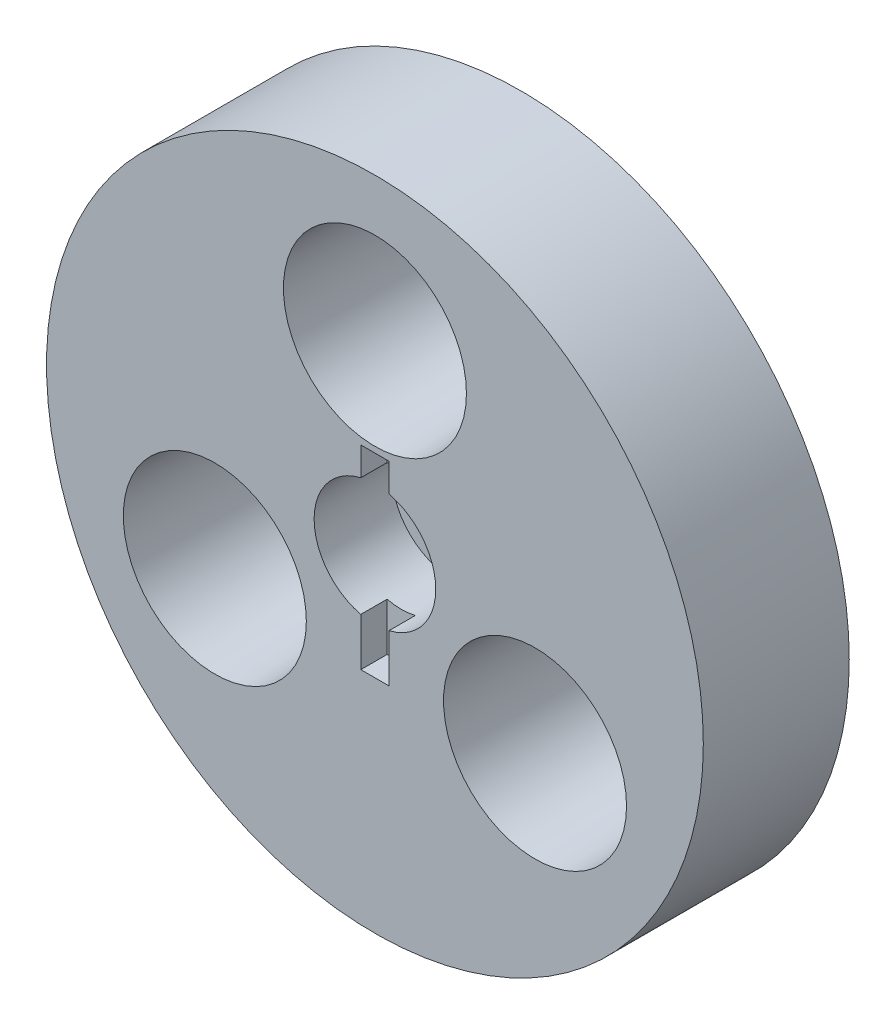
ISO-10303-21;
HEADER;
FILE_DESCRIPTION(('STEP AP214'),'2;1');
FILE_NAME('part.step','',(''),(''),'','','');
FILE_SCHEMA(('AUTOMOTIVE_DESIGN { 1 0 10303 214 1 1 1 1 }'));
ENDSEC;
DATA;
#1=APPLICATION_CONTEXT('core data for automotive mechanical design processes');
#2=APPLICATION_PROTOCOL_DEFINITION('international standard','automotive_design',2000,#1);
#3=PRODUCT_CONTEXT('',#1,'mechanical');
#4=PRODUCT('Part','Part','',(#3));
#5=PRODUCT_RELATED_PRODUCT_CATEGORY('part','',(#4));
#6=PRODUCT_DEFINITION_FORMATION('','',#4);
#7=PRODUCT_DEFINITION_CONTEXT('part definition',#1,'design');
#8=PRODUCT_DEFINITION('design','',#6,#7);
#9=PRODUCT_DEFINITION_SHAPE('','',#8);
#10=(LENGTH_UNIT() NAMED_UNIT(*) SI_UNIT(.MILLI.,.METRE.));
#11=(NAMED_UNIT(*) PLANE_ANGLE_UNIT() SI_UNIT($,.RADIAN.));
#12=(NAMED_UNIT(*) SI_UNIT($,.STERADIAN.) SOLID_ANGLE_UNIT());
#13=UNCERTAINTY_MEASURE_WITH_UNIT(LENGTH_MEASURE(1.E-05),#10,'distance_accuracy_value','');
#14=(GEOMETRIC_REPRESENTATION_CONTEXT(3) GLOBAL_UNCERTAINTY_ASSIGNED_CONTEXT((#13)) GLOBAL_UNIT_ASSIGNED_CONTEXT((#10,
#11,#12)) REPRESENTATION_CONTEXT('',''));
#15=CARTESIAN_POINT('',(0.,0.,0.));
#16=DIRECTION('',(0.,0.,1.));
#17=DIRECTION('',(1.,0.,0.));
#18=AXIS2_PLACEMENT_3D('',#15,#16,#17);
#19=CARTESIAN_POINT('',(0.,24.13,-9.525));
#20=DIRECTION('',(0.,0.,1.));
#21=DIRECTION('',(1.,0.,0.));
#22=AXIS2_PLACEMENT_3D('',#19,#20,#21);
#23=CONICAL_SURFACE('',#22,11.1125,0.0436332312998583);
#24=CARTESIAN_POINT('',(0.,24.13,9.525));
#25=DIRECTION('',(0.,0.,1.));
#26=DIRECTION('',(1.,0.,0.));
#27=AXIS2_PLACEMENT_3D('',#24,#25,#26);
#28=CIRCLE('',#27,11.9442409624072);
#29=CARTESIAN_POINT('',(11.9442409624072,24.13,9.525));
#30=VERTEX_POINT('',#29);
#31=EDGE_CURVE('E156',#30,#30,#28,.T.);
#32=ORIENTED_EDGE('',*,*,#31,.T.);
#33=EDGE_LOOP('',(#32));
#34=FACE_BOUND('',#33,.T.);
#35=CARTESIAN_POINT('',(0.,24.13,-9.525));
#36=DIRECTION('',(0.,0.,1.));
#37=DIRECTION('',(1.,0.,0.));
#38=AXIS2_PLACEMENT_3D('',#35,#36,#37);
#39=CIRCLE('',#38,11.1125);
#40=CARTESIAN_POINT('',(11.1125,24.13,-9.525));
#41=VERTEX_POINT('',#40);
#42=EDGE_CURVE('E162',#41,#41,#39,.T.);
#43=ORIENTED_EDGE('',*,*,#42,.F.);
#44=EDGE_LOOP('',(#43));
#45=FACE_BOUND('',#44,.T.);
#46=ADVANCED_FACE('F36',(#34,#45),#23,.F.);
#47=CARTESIAN_POINT('',(-20.8971929933185,-12.065,-9.525));
#48=DIRECTION('',(0.,0.,1.));
#49=DIRECTION('',(1.,0.,0.));
#50=AXIS2_PLACEMENT_3D('',#47,#48,#49);
#51=CONICAL_SURFACE('',#50,11.1125,0.0436332312998583);
#52=CARTESIAN_POINT('',(-20.8971929933185,-12.065,9.525));
#53=DIRECTION('',(0.,0.,1.));
#54=DIRECTION('',(1.,0.,0.));
#55=AXIS2_PLACEMENT_3D('',#52,#53,#54);
#56=CIRCLE('',#55,11.9442409624072);
#57=CARTESIAN_POINT('',(-8.95295203091137,-12.065,9.525));
#58=VERTEX_POINT('',#57);
#59=EDGE_CURVE('E177',#58,#58,#56,.T.);
#60=ORIENTED_EDGE('',*,*,#59,.T.);
#61=EDGE_LOOP('',(#60));
#62=FACE_BOUND('',#61,.T.);
#63=CARTESIAN_POINT('',(-20.8971929933185,-12.065,-9.525));
#64=DIRECTION('',(0.,0.,1.));
#65=DIRECTION('',(1.,0.,0.));
#66=AXIS2_PLACEMENT_3D('',#63,#64,#65);
#67=CIRCLE('',#66,11.1125);
#68=CARTESIAN_POINT('',(-9.78469299331853,-12.065,-9.525));
#69=VERTEX_POINT('',#68);
#70=EDGE_CURVE('E159',#69,#69,#67,.T.);
#71=ORIENTED_EDGE('',*,*,#70,.F.);
#72=EDGE_LOOP('',(#71));
#73=FACE_BOUND('',#72,.T.);
#74=ADVANCED_FACE('F211',(#62,#73),#51,.F.);
#75=CARTESIAN_POINT('',(20.8971929933185,-12.0649999999999,-9.525));
#76=DIRECTION('',(0.,0.,1.));
#77=DIRECTION('',(1.,0.,0.));
#78=AXIS2_PLACEMENT_3D('',#75,#76,#77);
#79=CONICAL_SURFACE('',#78,11.1125,0.0436332312998583);
#80=CARTESIAN_POINT('',(20.8971929933185,-12.0649999999999,9.525));
#81=DIRECTION('',(0.,0.,1.));
#82=DIRECTION('',(1.,0.,0.));
#83=AXIS2_PLACEMENT_3D('',#80,#81,#82);
#84=CIRCLE('',#83,11.9442409624072);
#85=CARTESIAN_POINT('',(32.8414339557257,-12.0649999999999,9.525));
#86=VERTEX_POINT('',#85);
#87=EDGE_CURVE('E39',#86,#86,#84,.T.);
#88=ORIENTED_EDGE('',*,*,#87,.T.);
#89=EDGE_LOOP('',(#88));
#90=FACE_BOUND('',#89,.T.);
#91=CARTESIAN_POINT('',(20.8971929933185,-12.0649999999999,-9.525));
#92=DIRECTION('',(0.,0.,1.));
#93=DIRECTION('',(1.,0.,0.));
#94=AXIS2_PLACEMENT_3D('',#91,#92,#93);
#95=CIRCLE('',#94,11.1125);
#96=CARTESIAN_POINT('',(32.0096929933185,-12.0649999999999,-9.525));
#97=VERTEX_POINT('',#96);
#98=EDGE_CURVE('E149',#97,#97,#95,.T.);
#99=ORIENTED_EDGE('',*,*,#98,.F.);
#100=EDGE_LOOP('',(#99));
#101=FACE_BOUND('',#100,.T.);
#102=ADVANCED_FACE('F195',(#90,#101),#79,.F.);
#103=CARTESIAN_POINT('',(0.,0.,9.525));
#104=DIRECTION('',(0.,0.,-1.));
#105=DIRECTION('',(-1.,0.,0.));
#106=AXIS2_PLACEMENT_3D('',#103,#104,#105);
#107=CYLINDRICAL_SURFACE('',#106,42.8625);
#108=CARTESIAN_POINT('',(0.,0.,9.525));
#109=DIRECTION('',(0.,0.,1.));
#110=DIRECTION('',(1.,0.,0.));
#111=AXIS2_PLACEMENT_3D('',#108,#109,#110);
#112=CIRCLE('',#111,42.8625);
#113=CARTESIAN_POINT('',(42.8625,0.,9.525));
#114=VERTEX_POINT('',#113);
#115=EDGE_CURVE('E153',#114,#114,#112,.T.);
#116=ORIENTED_EDGE('',*,*,#115,.F.);
#117=EDGE_LOOP('',(#116));
#118=FACE_BOUND('',#117,.T.);
#119=CARTESIAN_POINT('',(0.,0.,-9.525));
#120=DIRECTION('',(0.,0.,1.));
#121=DIRECTION('',(1.,0.,0.));
#122=AXIS2_PLACEMENT_3D('',#119,#120,#121);
#123=CIRCLE('',#122,42.8625);
#124=CARTESIAN_POINT('',(42.8625,0.,-9.525));
#125=VERTEX_POINT('',#124);
#126=EDGE_CURVE('E165',#125,#125,#123,.T.);
#127=ORIENTED_EDGE('',*,*,#126,.T.);
#128=EDGE_LOOP('',(#127));
#129=FACE_BOUND('',#128,.T.);
#130=ADVANCED_FACE('F188',(#118,#129),#107,.T.);
#131=CARTESIAN_POINT('',(0.,0.,9.525));
#132=DIRECTION('',(0.,0.,1.));
#133=DIRECTION('',(1.,0.,0.));
#134=AXIS2_PLACEMENT_3D('',#131,#132,#133);
#135=PLANE('',#134);
#136=DIRECTION('',(0.,1.,0.));
#137=VECTOR('',#136,1.);
#138=CARTESIAN_POINT('',(1.8415,11.43,9.525));
#139=LINE('',#138,#137);
#140=CARTESIAN_POINT('',(1.8415,-13.97,9.525));
#141=VERTEX_POINT('',#140);
#142=CARTESIAN_POINT('',(1.8415,-7.7209315500139,9.525));
#143=VERTEX_POINT('',#142);
#144=EDGE_CURVE('E130',#141,#143,#139,.T.);
#145=ORIENTED_EDGE('',*,*,#144,.F.);
#146=DIRECTION('',(1.,0.,0.));
#147=VECTOR('',#146,1.);
#148=CARTESIAN_POINT('',(1.8415,-13.97,9.525));
#149=LINE('',#148,#147);
#150=CARTESIAN_POINT('',(-1.8415,-13.97,9.525));
#151=VERTEX_POINT('',#150);
#152=EDGE_CURVE('E111',#151,#141,#149,.T.);
#153=ORIENTED_EDGE('',*,*,#152,.F.);
#154=DIRECTION('',(0.,-1.,0.));
#155=VECTOR('',#154,1.);
#156=CARTESIAN_POINT('',(-1.8415,11.43,9.525));
#157=LINE('',#156,#155);
#158=CARTESIAN_POINT('',(-1.8415,-7.7209315500139,9.525));
#159=VERTEX_POINT('',#158);
#160=EDGE_CURVE('E134',#159,#151,#157,.T.);
#161=ORIENTED_EDGE('',*,*,#160,.F.);
#162=CARTESIAN_POINT('',(0.,0.,9.525));
#163=DIRECTION('',(0.,0.,1.));
#164=DIRECTION('',(1.,0.,0.));
#165=AXIS2_PLACEMENT_3D('',#162,#163,#164);
#166=CIRCLE('',#165,7.9375);
#167=CARTESIAN_POINT('',(-1.8415,7.7209315500139,9.525));
#168=VERTEX_POINT('',#167);
#169=EDGE_CURVE('E150',#168,#159,#166,.T.);
#170=ORIENTED_EDGE('',*,*,#169,.F.);
#171=CARTESIAN_POINT('',(-1.8415,11.43,9.525));
#172=VERTEX_POINT('',#171);
#173=EDGE_CURVE('E135',#172,#168,#157,.T.);
#174=ORIENTED_EDGE('',*,*,#173,.F.);
#175=DIRECTION('',(-1.,0.,0.));
#176=VECTOR('',#175,1.);
#177=CARTESIAN_POINT('',(1.8415,11.43,9.525));
#178=LINE('',#177,#176);
#179=CARTESIAN_POINT('',(1.8415,11.43,9.525));
#180=VERTEX_POINT('',#179);
#181=EDGE_CURVE('E132',#180,#172,#178,.T.);
#182=ORIENTED_EDGE('',*,*,#181,.F.);
#183=CARTESIAN_POINT('',(1.8415,7.7209315500139,9.525));
#184=VERTEX_POINT('',#183);
#185=EDGE_CURVE('E117',#184,#180,#139,.T.);
#186=ORIENTED_EDGE('',*,*,#185,.F.);
#187=EDGE_CURVE('E141',#143,#184,#166,.T.);
#188=ORIENTED_EDGE('',*,*,#187,.F.);
#189=EDGE_LOOP('',(#145,#153,#161,#170,#174,#182,#186,#188));
#190=FACE_BOUND('',#189,.T.);
#191=ORIENTED_EDGE('',*,*,#87,.F.);
#192=EDGE_LOOP('',(#191));
#193=FACE_BOUND('',#192,.T.);
#194=ORIENTED_EDGE('',*,*,#59,.F.);
#195=EDGE_LOOP('',(#194));
#196=FACE_BOUND('',#195,.T.);
#197=ORIENTED_EDGE('',*,*,#31,.F.);
#198=EDGE_LOOP('',(#197));
#199=FACE_BOUND('',#198,.T.);
#200=ORIENTED_EDGE('',*,*,#115,.T.);
#201=EDGE_LOOP('',(#200));
#202=FACE_BOUND('',#201,.T.);
#203=ADVANCED_FACE('F184',(#190,#193,#196,#199,#202),#135,.T.);
#204=CARTESIAN_POINT('',(0.,0.,-9.525));
#205=DIRECTION('',(0.,0.,1.));
#206=DIRECTION('',(1.,0.,0.));
#207=AXIS2_PLACEMENT_3D('',#204,#205,#206);
#208=PLANE('',#207);
#209=ORIENTED_EDGE('',*,*,#98,.T.);
#210=EDGE_LOOP('',(#209));
#211=FACE_BOUND('',#210,.T.);
#212=ORIENTED_EDGE('',*,*,#70,.T.);
#213=EDGE_LOOP('',(#212));
#214=FACE_BOUND('',#213,.T.);
#215=ORIENTED_EDGE('',*,*,#42,.T.);
#216=EDGE_LOOP('',(#215));
#217=FACE_BOUND('',#216,.T.);
#218=ORIENTED_EDGE('',*,*,#126,.F.);
#219=EDGE_LOOP('',(#218));
#220=FACE_BOUND('',#219,.T.);
#221=ADVANCED_FACE('F187',(#211,#214,#217,#220),#208,.F.);
#222=CARTESIAN_POINT('',(0.,0.,-0.635));
#223=DIRECTION('',(0.,0.,1.));
#224=DIRECTION('',(1.,0.,0.));
#225=AXIS2_PLACEMENT_3D('',#222,#223,#224);
#226=CYLINDRICAL_SURFACE('',#225,7.9375);
#227=CARTESIAN_POINT('',(0.,0.,6.096));
#228=DIRECTION('',(0.,0.,-1.));
#229=DIRECTION('',(-1.,0.,0.));
#230=AXIS2_PLACEMENT_3D('',#227,#228,#229);
#231=CIRCLE('',#230,7.9375);
#232=CARTESIAN_POINT('',(-1.8415,-7.7209315500139,6.096));
#233=VERTEX_POINT('',#232);
#234=CARTESIAN_POINT('',(1.8415,-7.7209315500139,6.096));
#235=VERTEX_POINT('',#234);
#236=EDGE_CURVE('E170',#233,#235,#231,.F.);
#237=ORIENTED_EDGE('',*,*,#236,.T.);
#238=DIRECTION('',(0.,0.,1.));
#239=VECTOR('',#238,1.);
#240=CARTESIAN_POINT('',(1.8415,-7.7209315500139,-0.635));
#241=LINE('',#240,#239);
#242=EDGE_CURVE('E11',#235,#143,#241,.T.);
#243=ORIENTED_EDGE('',*,*,#242,.T.);
#244=ORIENTED_EDGE('',*,*,#187,.T.);
#245=DIRECTION('',(0.,0.,1.));
#246=VECTOR('',#245,1.);
#247=CARTESIAN_POINT('',(1.8415,7.7209315500139,-0.635));
#248=LINE('',#247,#246);
#249=CARTESIAN_POINT('',(1.8415,7.7209315500139,6.096));
#250=VERTEX_POINT('',#249);
#251=EDGE_CURVE('E173',#184,#250,#248,.F.);
#252=ORIENTED_EDGE('',*,*,#251,.T.);
#253=CARTESIAN_POINT('',(-1.8415,7.7209315500139,6.096));
#254=VERTEX_POINT('',#253);
#255=EDGE_CURVE('E108',#250,#254,#231,.F.);
#256=ORIENTED_EDGE('',*,*,#255,.T.);
#257=DIRECTION('',(0.,0.,1.));
#258=VECTOR('',#257,1.);
#259=CARTESIAN_POINT('',(-1.8415,7.7209315500139,-0.635));
#260=LINE('',#259,#258);
#261=EDGE_CURVE('E169',#254,#168,#260,.T.);
#262=ORIENTED_EDGE('',*,*,#261,.T.);
#263=ORIENTED_EDGE('',*,*,#169,.T.);
#264=DIRECTION('',(0.,0.,1.));
#265=VECTOR('',#264,1.);
#266=CARTESIAN_POINT('',(-1.8415,-7.7209315500139,-0.635));
#267=LINE('',#266,#265);
#268=EDGE_CURVE('E44',#159,#233,#267,.F.);
#269=ORIENTED_EDGE('',*,*,#268,.T.);
#270=EDGE_LOOP('',(#237,#243,#244,#252,#256,#262,#263,#269));
#271=FACE_BOUND('',#270,.T.);
#272=CARTESIAN_POINT('',(0.,0.,-0.635));
#273=DIRECTION('',(0.,0.,1.));
#274=DIRECTION('',(1.,0.,0.));
#275=AXIS2_PLACEMENT_3D('',#272,#273,#274);
#276=CIRCLE('',#275,7.9375);
#277=CARTESIAN_POINT('',(7.9375,0.,-0.635));
#278=VERTEX_POINT('',#277);
#279=EDGE_CURVE('E146',#278,#278,#276,.T.);
#280=ORIENTED_EDGE('',*,*,#279,.F.);
#281=EDGE_LOOP('',(#280));
#282=FACE_BOUND('',#281,.T.);
#283=ADVANCED_FACE('F200',(#271,#282),#226,.F.);
#284=CARTESIAN_POINT('',(0.,0.,-0.635));
#285=DIRECTION('',(0.,0.,1.));
#286=DIRECTION('',(1.,0.,0.));
#287=AXIS2_PLACEMENT_3D('',#284,#285,#286);
#288=PLANE('',#287);
#289=ORIENTED_EDGE('',*,*,#279,.T.);
#290=EDGE_LOOP('',(#289));
#291=FACE_BOUND('',#290,.T.);
#292=ADVANCED_FACE('F206',(#291),#288,.T.);
#293=CARTESIAN_POINT('',(0.,0.,6.096));
#294=DIRECTION('',(0.,0.,-1.));
#295=DIRECTION('',(-1.,0.,0.));
#296=AXIS2_PLACEMENT_3D('',#293,#294,#295);
#297=PLANE('',#296);
#298=DIRECTION('',(0.,1.,0.));
#299=VECTOR('',#298,1.);
#300=CARTESIAN_POINT('',(1.8415,11.43,6.096));
#301=LINE('',#300,#299);
#302=CARTESIAN_POINT('',(1.8415,11.43,6.096));
#303=VERTEX_POINT('',#302);
#304=EDGE_CURVE('E102',#250,#303,#301,.T.);
#305=ORIENTED_EDGE('',*,*,#304,.T.);
#306=DIRECTION('',(-1.,0.,0.));
#307=VECTOR('',#306,1.);
#308=CARTESIAN_POINT('',(1.8415,11.43,6.096));
#309=LINE('',#308,#307);
#310=CARTESIAN_POINT('',(-1.8415,11.43,6.096));
#311=VERTEX_POINT('',#310);
#312=EDGE_CURVE('E106',#303,#311,#309,.T.);
#313=ORIENTED_EDGE('',*,*,#312,.T.);
#314=DIRECTION('',(0.,-1.,0.));
#315=VECTOR('',#314,1.);
#316=CARTESIAN_POINT('',(-1.8415,11.43,6.096));
#317=LINE('',#316,#315);
#318=EDGE_CURVE('E60',#311,#254,#317,.T.);
#319=ORIENTED_EDGE('',*,*,#318,.T.);
#320=ORIENTED_EDGE('',*,*,#255,.F.);
#321=EDGE_LOOP('',(#305,#313,#319,#320));
#322=FACE_BOUND('',#321,.T.);
#323=ADVANCED_FACE('F104',(#322),#297,.F.);
#324=CARTESIAN_POINT('',(-1.8415,11.43,6.096));
#325=DIRECTION('',(-1.,0.,0.));
#326=DIRECTION('',(0.,-1.,0.));
#327=AXIS2_PLACEMENT_3D('',#324,#325,#326);
#328=PLANE('',#327);
#329=ORIENTED_EDGE('',*,*,#318,.F.);
#330=DIRECTION('',(0.,0.,1.));
#331=VECTOR('',#330,1.);
#332=CARTESIAN_POINT('',(-1.8415,11.43,6.096));
#333=LINE('',#332,#331);
#334=EDGE_CURVE('E121',#311,#172,#333,.T.);
#335=ORIENTED_EDGE('',*,*,#334,.T.);
#336=ORIENTED_EDGE('',*,*,#173,.T.);
#337=ORIENTED_EDGE('',*,*,#261,.F.);
#338=EDGE_LOOP('',(#329,#335,#336,#337));
#339=FACE_BOUND('',#338,.T.);
#340=ADVANCED_FACE('F271',(#339),#328,.F.);
#341=CARTESIAN_POINT('',(1.8415,11.43,6.096));
#342=DIRECTION('',(1.,0.,0.));
#343=DIRECTION('',(0.,1.,0.));
#344=AXIS2_PLACEMENT_3D('',#341,#342,#343);
#345=PLANE('',#344);
#346=ORIENTED_EDGE('',*,*,#185,.T.);
#347=DIRECTION('',(0.,0.,1.));
#348=VECTOR('',#347,1.);
#349=CARTESIAN_POINT('',(1.8415,11.43,6.096));
#350=LINE('',#349,#348);
#351=EDGE_CURVE('E114',#303,#180,#350,.T.);
#352=ORIENTED_EDGE('',*,*,#351,.F.);
#353=ORIENTED_EDGE('',*,*,#304,.F.);
#354=ORIENTED_EDGE('',*,*,#251,.F.);
#355=EDGE_LOOP('',(#346,#352,#353,#354));
#356=FACE_BOUND('',#355,.T.);
#357=ADVANCED_FACE('F115',(#356),#345,.F.);
#358=CARTESIAN_POINT('',(1.8415,11.43,6.096));
#359=DIRECTION('',(0.,1.,0.));
#360=DIRECTION('',(0.,0.,1.));
#361=AXIS2_PLACEMENT_3D('',#358,#359,#360);
#362=PLANE('',#361);
#363=ORIENTED_EDGE('',*,*,#181,.T.);
#364=ORIENTED_EDGE('',*,*,#334,.F.);
#365=ORIENTED_EDGE('',*,*,#312,.F.);
#366=ORIENTED_EDGE('',*,*,#351,.T.);
#367=EDGE_LOOP('',(#363,#364,#365,#366));
#368=FACE_BOUND('',#367,.T.);
#369=ADVANCED_FACE('F124',(#368),#362,.F.);
#370=CARTESIAN_POINT('',(1.8415,-13.97,6.096));
#371=VERTEX_POINT('',#370);
#372=EDGE_CURVE('E52',#371,#235,#301,.T.);
#373=ORIENTED_EDGE('',*,*,#372,.F.);
#374=DIRECTION('',(0.,0.,1.));
#375=VECTOR('',#374,1.);
#376=CARTESIAN_POINT('',(1.8415,-13.97,6.096));
#377=LINE('',#376,#375);
#378=EDGE_CURVE('E139',#371,#141,#377,.T.);
#379=ORIENTED_EDGE('',*,*,#378,.T.);
#380=ORIENTED_EDGE('',*,*,#144,.T.);
#381=ORIENTED_EDGE('',*,*,#242,.F.);
#382=EDGE_LOOP('',(#373,#379,#380,#381));
#383=FACE_BOUND('',#382,.T.);
#384=ADVANCED_FACE('F290',(#383),#345,.F.);
#385=ORIENTED_EDGE('',*,*,#160,.T.);
#386=DIRECTION('',(0.,0.,1.));
#387=VECTOR('',#386,1.);
#388=CARTESIAN_POINT('',(-1.8415,-13.97,6.096));
#389=LINE('',#388,#387);
#390=CARTESIAN_POINT('',(-1.8415,-13.97,6.096));
#391=VERTEX_POINT('',#390);
#392=EDGE_CURVE('E142',#391,#151,#389,.T.);
#393=ORIENTED_EDGE('',*,*,#392,.F.);
#394=EDGE_CURVE('E125',#233,#391,#317,.T.);
#395=ORIENTED_EDGE('',*,*,#394,.F.);
#396=ORIENTED_EDGE('',*,*,#268,.F.);
#397=EDGE_LOOP('',(#385,#393,#395,#396));
#398=FACE_BOUND('',#397,.T.);
#399=ADVANCED_FACE('F282',(#398),#328,.F.);
#400=ORIENTED_EDGE('',*,*,#394,.T.);
#401=DIRECTION('',(1.,0.,0.));
#402=VECTOR('',#401,1.);
#403=CARTESIAN_POINT('',(1.8415,-13.97,6.096));
#404=LINE('',#403,#402);
#405=EDGE_CURVE('E122',#391,#371,#404,.T.);
#406=ORIENTED_EDGE('',*,*,#405,.T.);
#407=ORIENTED_EDGE('',*,*,#372,.T.);
#408=ORIENTED_EDGE('',*,*,#236,.F.);
#409=EDGE_LOOP('',(#400,#406,#407,#408));
#410=FACE_BOUND('',#409,.T.);
#411=ADVANCED_FACE('F273',(#410),#297,.F.);
#412=CARTESIAN_POINT('',(1.8415,-13.97,6.096));
#413=DIRECTION('',(0.,-1.,0.));
#414=DIRECTION('',(0.,0.,-1.));
#415=AXIS2_PLACEMENT_3D('',#412,#413,#414);
#416=PLANE('',#415);
#417=ORIENTED_EDGE('',*,*,#152,.T.);
#418=ORIENTED_EDGE('',*,*,#378,.F.);
#419=ORIENTED_EDGE('',*,*,#405,.F.);
#420=ORIENTED_EDGE('',*,*,#392,.T.);
#421=EDGE_LOOP('',(#417,#418,#419,#420));
#422=FACE_BOUND('',#421,.T.);
#423=ADVANCED_FACE('F318',(#422),#416,.F.);
#424=CLOSED_SHELL('',(#46,#74,#102,#130,#203,#221,#283,#292,#323,#340,#357,#369,#384,#399,#411,#423));
#425=MANIFOLD_SOLID_BREP('B2',#424);
#426=ADVANCED_BREP_SHAPE_REPRESENTATION('',(#18,#425),#14);
#427=SHAPE_DEFINITION_REPRESENTATION(#9,#426);
ENDSEC;
END-ISO-10303-21;
